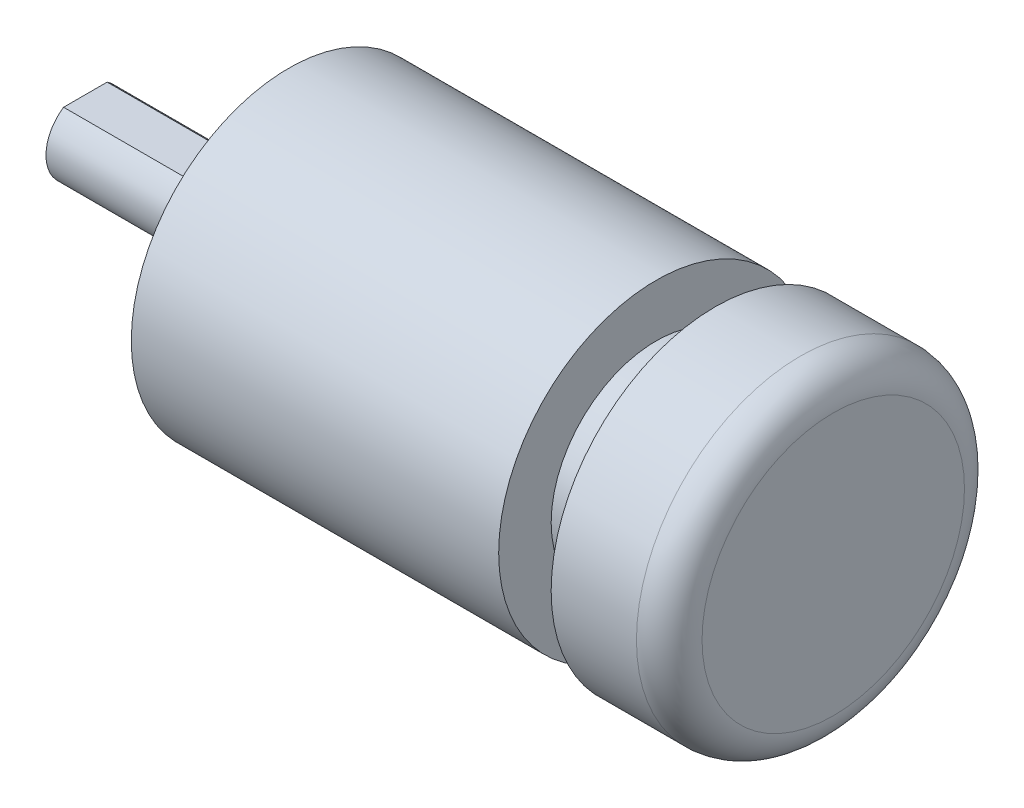
ISO-10303-21;
HEADER;
FILE_DESCRIPTION(('STEP AP214'),'2;1');
FILE_NAME('part.step','',(''),(''),'','','');
FILE_SCHEMA(('AUTOMOTIVE_DESIGN { 1 0 10303 214 1 1 1 1 }'));
ENDSEC;
DATA;
#1=APPLICATION_CONTEXT('core data for automotive mechanical design processes');
#2=APPLICATION_PROTOCOL_DEFINITION('international standard','automotive_design',2000,#1);
#3=PRODUCT_CONTEXT('',#1,'mechanical');
#4=PRODUCT('Part','Part','',(#3));
#5=PRODUCT_RELATED_PRODUCT_CATEGORY('part','',(#4));
#6=PRODUCT_DEFINITION_FORMATION('','',#4);
#7=PRODUCT_DEFINITION_CONTEXT('part definition',#1,'design');
#8=PRODUCT_DEFINITION('design','',#6,#7);
#9=PRODUCT_DEFINITION_SHAPE('','',#8);
#10=(LENGTH_UNIT() NAMED_UNIT(*) SI_UNIT(.MILLI.,.METRE.));
#11=(NAMED_UNIT(*) PLANE_ANGLE_UNIT() SI_UNIT($,.RADIAN.));
#12=(NAMED_UNIT(*) SI_UNIT($,.STERADIAN.) SOLID_ANGLE_UNIT());
#13=UNCERTAINTY_MEASURE_WITH_UNIT(LENGTH_MEASURE(1.E-05),#10,'distance_accuracy_value','');
#14=(GEOMETRIC_REPRESENTATION_CONTEXT(3) GLOBAL_UNCERTAINTY_ASSIGNED_CONTEXT((#13)) GLOBAL_UNIT_ASSIGNED_CONTEXT((#10,
#11,#12)) REPRESENTATION_CONTEXT('',''));
#15=CARTESIAN_POINT('',(0.,0.,0.));
#16=DIRECTION('',(0.,0.,1.));
#17=DIRECTION('',(1.,0.,0.));
#18=AXIS2_PLACEMENT_3D('',#15,#16,#17);
#19=CARTESIAN_POINT('',(-43.5,0.,0.));
#20=DIRECTION('',(-1.,0.,0.));
#21=DIRECTION('',(0.,0.,1.));
#22=AXIS2_PLACEMENT_3D('',#19,#20,#21);
#23=PLANE('',#22);
#24=CARTESIAN_POINT('',(-43.5,0.,0.));
#25=DIRECTION('',(-1.,0.,0.));
#26=DIRECTION('',(0.,0.,1.));
#27=AXIS2_PLACEMENT_3D('',#24,#25,#26);
#28=CIRCLE('',#27,2.99999999999999);
#29=CARTESIAN_POINT('',(-43.5,2.49999999999999,1.6583123951777));
#30=VERTEX_POINT('',#29);
#31=CARTESIAN_POINT('',(-43.5,2.49999999999999,-1.6583123951777));
#32=VERTEX_POINT('',#31);
#33=EDGE_CURVE('E78',#30,#32,#28,.F.);
#34=ORIENTED_EDGE('',*,*,#33,.F.);
#35=DIRECTION('',(0.,0.,-1.));
#36=VECTOR('',#35,1.);
#37=CARTESIAN_POINT('',(-43.5,2.49999999999999,-1.6583123951777));
#38=LINE('',#37,#36);
#39=EDGE_CURVE('E86',#30,#32,#38,.T.);
#40=ORIENTED_EDGE('',*,*,#39,.T.);
#41=EDGE_LOOP('',(#34,#40));
#42=FACE_BOUND('',#41,.T.);
#43=ADVANCED_FACE('F43',(#42),#23,.T.);
#44=CARTESIAN_POINT('',(13.5,0.,0.));
#45=DIRECTION('',(1.,0.,0.));
#46=DIRECTION('',(0.,0.,-1.));
#47=AXIS2_PLACEMENT_3D('',#44,#45,#46);
#48=PLANE('',#47);
#49=CARTESIAN_POINT('',(13.5,0.,0.));
#50=DIRECTION('',(-1.,0.,0.));
#51=DIRECTION('',(0.,0.,1.));
#52=AXIS2_PLACEMENT_3D('',#49,#50,#51);
#53=CIRCLE('',#52,10.);
#54=CARTESIAN_POINT('',(13.5,0.,10.));
#55=VERTEX_POINT('',#54);
#56=CARTESIAN_POINT('',(13.5,0.,-10.));
#57=VERTEX_POINT('',#56);
#58=EDGE_CURVE('E109',#55,#57,#53,.T.);
#59=ORIENTED_EDGE('',*,*,#58,.F.);
#60=CARTESIAN_POINT('',(13.5,0.,0.));
#61=DIRECTION('',(-1.,0.,0.));
#62=DIRECTION('',(0.,0.,-1.));
#63=AXIS2_PLACEMENT_3D('',#60,#61,#62);
#64=CIRCLE('',#63,10.);
#65=EDGE_CURVE('E71',#57,#55,#64,.T.);
#66=ORIENTED_EDGE('',*,*,#65,.F.);
#67=EDGE_LOOP('',(#59,#66));
#68=FACE_BOUND('',#67,.T.);
#69=ADVANCED_FACE('F191',(#68),#48,.T.);
#70=CARTESIAN_POINT('',(11.,0.,0.));
#71=DIRECTION('',(1.,0.,0.));
#72=DIRECTION('',(0.,0.,-1.));
#73=AXIS2_PLACEMENT_3D('',#70,#71,#72);
#74=TOROIDAL_SURFACE('',#73,10.,2.5);
#75=ORIENTED_EDGE('',*,*,#65,.T.);
#76=ORIENTED_EDGE('',*,*,#58,.T.);
#77=EDGE_LOOP('',(#75,#76));
#78=FACE_BOUND('',#77,.T.);
#79=CARTESIAN_POINT('',(11.,0.,0.));
#80=DIRECTION('',(1.,0.,0.));
#81=DIRECTION('',(0.,0.,-1.));
#82=AXIS2_PLACEMENT_3D('',#79,#80,#81);
#83=CIRCLE('',#82,12.5);
#84=CARTESIAN_POINT('',(11.,0.,-12.5));
#85=VERTEX_POINT('',#84);
#86=EDGE_CURVE('E110',#85,#85,#83,.F.);
#87=ORIENTED_EDGE('',*,*,#86,.F.);
#88=EDGE_LOOP('',(#87));
#89=FACE_BOUND('',#88,.T.);
#90=ADVANCED_FACE('F179',(#78,#89),#74,.T.);
#91=CARTESIAN_POINT('',(4.5,0.,0.));
#92=DIRECTION('',(1.,0.,0.));
#93=DIRECTION('',(0.,0.,-1.));
#94=AXIS2_PLACEMENT_3D('',#91,#92,#93);
#95=CYLINDRICAL_SURFACE('',#94,12.5);
#96=ORIENTED_EDGE('',*,*,#86,.T.);
#97=EDGE_LOOP('',(#96));
#98=FACE_BOUND('',#97,.T.);
#99=CARTESIAN_POINT('',(4.5,0.,0.));
#100=DIRECTION('',(1.,0.,0.));
#101=DIRECTION('',(0.,0.,-1.));
#102=AXIS2_PLACEMENT_3D('',#99,#100,#101);
#103=CIRCLE('',#102,12.5);
#104=CARTESIAN_POINT('',(4.5,0.,-12.5));
#105=VERTEX_POINT('',#104);
#106=EDGE_CURVE('E115',#105,#105,#103,.T.);
#107=ORIENTED_EDGE('',*,*,#106,.T.);
#108=EDGE_LOOP('',(#107));
#109=FACE_BOUND('',#108,.T.);
#110=ADVANCED_FACE('F190',(#98,#109),#95,.T.);
#111=CARTESIAN_POINT('',(4.5,0.,0.));
#112=DIRECTION('',(1.,0.,0.));
#113=DIRECTION('',(0.,0.,-1.));
#114=AXIS2_PLACEMENT_3D('',#111,#112,#113);
#115=PLANE('',#114);
#116=ORIENTED_EDGE('',*,*,#106,.F.);
#117=EDGE_LOOP('',(#116));
#118=FACE_BOUND('',#117,.T.);
#119=CARTESIAN_POINT('',(4.5,0.,0.));
#120=DIRECTION('',(-1.,0.,0.));
#121=DIRECTION('',(0.,0.,1.));
#122=AXIS2_PLACEMENT_3D('',#119,#120,#121);
#123=CIRCLE('',#122,8.);
#124=CARTESIAN_POINT('',(4.5,0.,8.));
#125=VERTEX_POINT('',#124);
#126=EDGE_CURVE('E139',#125,#125,#123,.T.);
#127=ORIENTED_EDGE('',*,*,#126,.F.);
#128=EDGE_LOOP('',(#127));
#129=FACE_BOUND('',#128,.T.);
#130=ADVANCED_FACE('F209',(#118,#129),#115,.F.);
#131=CARTESIAN_POINT('',(13.502,0.,0.));
#132=DIRECTION('',(-1.,0.,0.));
#133=DIRECTION('',(0.,0.,1.));
#134=AXIS2_PLACEMENT_3D('',#131,#132,#133);
#135=CYLINDRICAL_SURFACE('',#134,8.);
#136=CARTESIAN_POINT('',(0.,0.,0.));
#137=DIRECTION('',(-1.,0.,0.));
#138=DIRECTION('',(0.,0.,1.));
#139=AXIS2_PLACEMENT_3D('',#136,#137,#138);
#140=CIRCLE('',#139,8.);
#141=CARTESIAN_POINT('',(0.,0.,8.));
#142=VERTEX_POINT('',#141);
#143=EDGE_CURVE('E163',#142,#142,#140,.T.);
#144=ORIENTED_EDGE('',*,*,#143,.F.);
#145=EDGE_LOOP('',(#144));
#146=FACE_BOUND('',#145,.T.);
#147=ORIENTED_EDGE('',*,*,#126,.T.);
#148=EDGE_LOOP('',(#147));
#149=FACE_BOUND('',#148,.T.);
#150=ADVANCED_FACE('F214',(#146,#149),#135,.T.);
#151=CARTESIAN_POINT('',(-22.,9.,0.));
#152=DIRECTION('',(-1.,0.,0.));
#153=DIRECTION('',(0.,0.,1.));
#154=AXIS2_PLACEMENT_3D('',#151,#152,#153);
#155=PLANE('',#154);
#156=CARTESIAN_POINT('',(-22.,9.,0.));
#157=DIRECTION('',(-1.,0.,0.));
#158=DIRECTION('',(0.,0.,1.));
#159=AXIS2_PLACEMENT_3D('',#156,#157,#158);
#160=CIRCLE('',#159,1.);
#161=CARTESIAN_POINT('',(-22.,9.,1.));
#162=VERTEX_POINT('',#161);
#163=EDGE_CURVE('E119',#162,#162,#160,.T.);
#164=ORIENTED_EDGE('',*,*,#163,.T.);
#165=EDGE_LOOP('',(#164));
#166=FACE_BOUND('',#165,.T.);
#167=ADVANCED_FACE('F219',(#166),#155,.T.);
#168=CARTESIAN_POINT('',(-22.,0.,9.));
#169=DIRECTION('',(-1.,0.,0.));
#170=DIRECTION('',(0.,0.,1.));
#171=AXIS2_PLACEMENT_3D('',#168,#169,#170);
#172=PLANE('',#171);
#173=CARTESIAN_POINT('',(-22.,0.,9.));
#174=DIRECTION('',(-1.,0.,0.));
#175=DIRECTION('',(0.,0.,1.));
#176=AXIS2_PLACEMENT_3D('',#173,#174,#175);
#177=CIRCLE('',#176,1.);
#178=CARTESIAN_POINT('',(-22.,0.,10.));
#179=VERTEX_POINT('',#178);
#180=EDGE_CURVE('E123',#179,#179,#177,.T.);
#181=ORIENTED_EDGE('',*,*,#180,.T.);
#182=EDGE_LOOP('',(#181));
#183=FACE_BOUND('',#182,.T.);
#184=ADVANCED_FACE('F225',(#183),#172,.T.);
#185=CARTESIAN_POINT('',(-22.,-9.,0.));
#186=DIRECTION('',(-1.,0.,0.));
#187=DIRECTION('',(0.,0.,1.));
#188=AXIS2_PLACEMENT_3D('',#185,#186,#187);
#189=PLANE('',#188);
#190=CARTESIAN_POINT('',(-22.,-9.,0.));
#191=DIRECTION('',(-1.,0.,0.));
#192=DIRECTION('',(0.,0.,1.));
#193=AXIS2_PLACEMENT_3D('',#190,#191,#192);
#194=CIRCLE('',#193,1.);
#195=CARTESIAN_POINT('',(-22.,-9.,1.));
#196=VERTEX_POINT('',#195);
#197=EDGE_CURVE('E127',#196,#196,#194,.T.);
#198=ORIENTED_EDGE('',*,*,#197,.T.);
#199=EDGE_LOOP('',(#198));
#200=FACE_BOUND('',#199,.T.);
#201=ADVANCED_FACE('F394',(#200),#189,.T.);
#202=CARTESIAN_POINT('',(-22.,0.,-9.));
#203=DIRECTION('',(-1.,0.,0.));
#204=DIRECTION('',(0.,0.,1.));
#205=AXIS2_PLACEMENT_3D('',#202,#203,#204);
#206=PLANE('',#205);
#207=CARTESIAN_POINT('',(-22.,0.,-9.));
#208=DIRECTION('',(-1.,0.,0.));
#209=DIRECTION('',(0.,0.,1.));
#210=AXIS2_PLACEMENT_3D('',#207,#208,#209);
#211=CIRCLE('',#210,1.);
#212=CARTESIAN_POINT('',(-22.,0.,-8.));
#213=VERTEX_POINT('',#212);
#214=EDGE_CURVE('E131',#213,#213,#211,.T.);
#215=ORIENTED_EDGE('',*,*,#214,.T.);
#216=EDGE_LOOP('',(#215));
#217=FACE_BOUND('',#216,.T.);
#218=ADVANCED_FACE('F384',(#217),#206,.T.);
#219=CARTESIAN_POINT('',(0.,0.,0.));
#220=DIRECTION('',(1.,0.,0.));
#221=DIRECTION('',(0.,0.,-1.));
#222=AXIS2_PLACEMENT_3D('',#219,#220,#221);
#223=PLANE('',#222);
#224=CARTESIAN_POINT('',(0.,0.,0.));
#225=DIRECTION('',(1.,0.,0.));
#226=DIRECTION('',(0.,0.,-1.));
#227=AXIS2_PLACEMENT_3D('',#224,#225,#226);
#228=CIRCLE('',#227,12.);
#229=CARTESIAN_POINT('',(0.,0.,-12.));
#230=VERTEX_POINT('',#229);
#231=EDGE_CURVE('E85',#230,#230,#228,.F.);
#232=ORIENTED_EDGE('',*,*,#231,.F.);
#233=EDGE_LOOP('',(#232));
#234=FACE_BOUND('',#233,.T.);
#235=ORIENTED_EDGE('',*,*,#143,.T.);
#236=EDGE_LOOP('',(#235));
#237=FACE_BOUND('',#236,.T.);
#238=ADVANCED_FACE('F374',(#234,#237),#223,.T.);
#239=CARTESIAN_POINT('',(-22.,9.,0.));
#240=DIRECTION('',(-1.,0.,0.));
#241=DIRECTION('',(0.,0.,1.));
#242=AXIS2_PLACEMENT_3D('',#239,#240,#241);
#243=CYLINDRICAL_SURFACE('',#242,1.);
#244=CARTESIAN_POINT('',(-28.,9.,0.));
#245=DIRECTION('',(-1.,0.,0.));
#246=DIRECTION('',(0.,0.,1.));
#247=AXIS2_PLACEMENT_3D('',#244,#245,#246);
#248=CIRCLE('',#247,1.);
#249=CARTESIAN_POINT('',(-28.,9.,1.));
#250=VERTEX_POINT('',#249);
#251=EDGE_CURVE('E143',#250,#250,#248,.F.);
#252=ORIENTED_EDGE('',*,*,#251,.F.);
#253=EDGE_LOOP('',(#252));
#254=FACE_BOUND('',#253,.T.);
#255=ORIENTED_EDGE('',*,*,#163,.F.);
#256=EDGE_LOOP('',(#255));
#257=FACE_BOUND('',#256,.T.);
#258=ADVANCED_FACE('F364',(#254,#257),#243,.F.);
#259=CARTESIAN_POINT('',(-22.,0.,9.));
#260=DIRECTION('',(-1.,0.,0.));
#261=DIRECTION('',(0.,0.,1.));
#262=AXIS2_PLACEMENT_3D('',#259,#260,#261);
#263=CYLINDRICAL_SURFACE('',#262,1.);
#264=CARTESIAN_POINT('',(-28.,0.,9.));
#265=DIRECTION('',(-1.,0.,0.));
#266=DIRECTION('',(0.,0.,1.));
#267=AXIS2_PLACEMENT_3D('',#264,#265,#266);
#268=CIRCLE('',#267,1.);
#269=CARTESIAN_POINT('',(-28.,0.,10.));
#270=VERTEX_POINT('',#269);
#271=EDGE_CURVE('E147',#270,#270,#268,.F.);
#272=ORIENTED_EDGE('',*,*,#271,.F.);
#273=EDGE_LOOP('',(#272));
#274=FACE_BOUND('',#273,.T.);
#275=ORIENTED_EDGE('',*,*,#180,.F.);
#276=EDGE_LOOP('',(#275));
#277=FACE_BOUND('',#276,.T.);
#278=ADVANCED_FACE('F354',(#274,#277),#263,.F.);
#279=CARTESIAN_POINT('',(-22.,-9.,0.));
#280=DIRECTION('',(-1.,0.,0.));
#281=DIRECTION('',(0.,0.,1.));
#282=AXIS2_PLACEMENT_3D('',#279,#280,#281);
#283=CYLINDRICAL_SURFACE('',#282,1.);
#284=CARTESIAN_POINT('',(-28.,-9.,0.));
#285=DIRECTION('',(-1.,0.,0.));
#286=DIRECTION('',(0.,0.,1.));
#287=AXIS2_PLACEMENT_3D('',#284,#285,#286);
#288=CIRCLE('',#287,1.);
#289=CARTESIAN_POINT('',(-28.,-9.,1.));
#290=VERTEX_POINT('',#289);
#291=EDGE_CURVE('E151',#290,#290,#288,.F.);
#292=ORIENTED_EDGE('',*,*,#291,.F.);
#293=EDGE_LOOP('',(#292));
#294=FACE_BOUND('',#293,.T.);
#295=ORIENTED_EDGE('',*,*,#197,.F.);
#296=EDGE_LOOP('',(#295));
#297=FACE_BOUND('',#296,.T.);
#298=ADVANCED_FACE('F344',(#294,#297),#283,.F.);
#299=CARTESIAN_POINT('',(-22.,0.,-9.));
#300=DIRECTION('',(-1.,0.,0.));
#301=DIRECTION('',(0.,0.,1.));
#302=AXIS2_PLACEMENT_3D('',#299,#300,#301);
#303=CYLINDRICAL_SURFACE('',#302,1.);
#304=CARTESIAN_POINT('',(-28.,0.,-9.));
#305=DIRECTION('',(-1.,0.,0.));
#306=DIRECTION('',(0.,0.,1.));
#307=AXIS2_PLACEMENT_3D('',#304,#305,#306);
#308=CIRCLE('',#307,1.);
#309=CARTESIAN_POINT('',(-28.,0.,-8.));
#310=VERTEX_POINT('',#309);
#311=EDGE_CURVE('E155',#310,#310,#308,.F.);
#312=ORIENTED_EDGE('',*,*,#311,.F.);
#313=EDGE_LOOP('',(#312));
#314=FACE_BOUND('',#313,.T.);
#315=ORIENTED_EDGE('',*,*,#214,.F.);
#316=EDGE_LOOP('',(#315));
#317=FACE_BOUND('',#316,.T.);
#318=ADVANCED_FACE('F332',(#314,#317),#303,.F.);
#319=CARTESIAN_POINT('',(0.,0.,0.));
#320=DIRECTION('',(1.,0.,0.));
#321=DIRECTION('',(0.,0.,-1.));
#322=AXIS2_PLACEMENT_3D('',#319,#320,#321);
#323=CYLINDRICAL_SURFACE('',#322,12.);
#324=ORIENTED_EDGE('',*,*,#231,.T.);
#325=EDGE_LOOP('',(#324));
#326=FACE_BOUND('',#325,.T.);
#327=CARTESIAN_POINT('',(-28.,0.,0.));
#328=DIRECTION('',(1.,0.,0.));
#329=DIRECTION('',(0.,0.,-1.));
#330=AXIS2_PLACEMENT_3D('',#327,#328,#329);
#331=CIRCLE('',#330,12.);
#332=CARTESIAN_POINT('',(-28.,0.,-12.));
#333=VERTEX_POINT('',#332);
#334=EDGE_CURVE('E167',#333,#333,#331,.T.);
#335=ORIENTED_EDGE('',*,*,#334,.T.);
#336=EDGE_LOOP('',(#335));
#337=FACE_BOUND('',#336,.T.);
#338=ADVANCED_FACE('F322',(#326,#337),#323,.T.);
#339=CARTESIAN_POINT('',(-28.,12.,0.));
#340=DIRECTION('',(-1.,0.,0.));
#341=DIRECTION('',(0.,0.,1.));
#342=AXIS2_PLACEMENT_3D('',#339,#340,#341);
#343=PLANE('',#342);
#344=ORIENTED_EDGE('',*,*,#334,.F.);
#345=EDGE_LOOP('',(#344));
#346=FACE_BOUND('',#345,.T.);
#347=CARTESIAN_POINT('',(-28.,0.,0.));
#348=DIRECTION('',(1.,0.,0.));
#349=DIRECTION('',(0.,0.,-1.));
#350=AXIS2_PLACEMENT_3D('',#347,#348,#349);
#351=CIRCLE('',#350,7.);
#352=CARTESIAN_POINT('',(-28.,0.,-7.));
#353=VERTEX_POINT('',#352);
#354=EDGE_CURVE('E159',#353,#353,#351,.T.);
#355=ORIENTED_EDGE('',*,*,#354,.T.);
#356=EDGE_LOOP('',(#355));
#357=FACE_BOUND('',#356,.T.);
#358=ORIENTED_EDGE('',*,*,#311,.T.);
#359=EDGE_LOOP('',(#358));
#360=FACE_BOUND('',#359,.T.);
#361=ORIENTED_EDGE('',*,*,#291,.T.);
#362=EDGE_LOOP('',(#361));
#363=FACE_BOUND('',#362,.T.);
#364=ORIENTED_EDGE('',*,*,#271,.T.);
#365=EDGE_LOOP('',(#364));
#366=FACE_BOUND('',#365,.T.);
#367=ORIENTED_EDGE('',*,*,#251,.T.);
#368=EDGE_LOOP('',(#367));
#369=FACE_BOUND('',#368,.T.);
#370=ADVANCED_FACE('F313',(#346,#357,#360,#363,#366,#369),#343,.T.);
#371=CARTESIAN_POINT('',(0.,0.,0.));
#372=DIRECTION('',(1.,0.,0.));
#373=DIRECTION('',(0.,0.,-1.));
#374=AXIS2_PLACEMENT_3D('',#371,#372,#373);
#375=CYLINDRICAL_SURFACE('',#374,7.);
#376=CARTESIAN_POINT('',(-29.5,0.,0.));
#377=DIRECTION('',(1.,0.,0.));
#378=DIRECTION('',(0.,0.,-1.));
#379=AXIS2_PLACEMENT_3D('',#376,#377,#378);
#380=CIRCLE('',#379,7.);
#381=CARTESIAN_POINT('',(-29.5,0.,-7.));
#382=VERTEX_POINT('',#381);
#383=EDGE_CURVE('E135',#382,#382,#380,.T.);
#384=ORIENTED_EDGE('',*,*,#383,.T.);
#385=EDGE_LOOP('',(#384));
#386=FACE_BOUND('',#385,.T.);
#387=ORIENTED_EDGE('',*,*,#354,.F.);
#388=EDGE_LOOP('',(#387));
#389=FACE_BOUND('',#388,.T.);
#390=ADVANCED_FACE('F265',(#386,#389),#375,.T.);
#391=CARTESIAN_POINT('',(-29.5,7.,0.));
#392=DIRECTION('',(-1.,0.,0.));
#393=DIRECTION('',(0.,0.,1.));
#394=AXIS2_PLACEMENT_3D('',#391,#392,#393);
#395=PLANE('',#394);
#396=ORIENTED_EDGE('',*,*,#383,.F.);
#397=EDGE_LOOP('',(#396));
#398=FACE_BOUND('',#397,.T.);
#399=CARTESIAN_POINT('',(-29.5,0.,0.));
#400=DIRECTION('',(1.,0.,0.));
#401=DIRECTION('',(0.,0.,-1.));
#402=AXIS2_PLACEMENT_3D('',#399,#400,#401);
#403=CIRCLE('',#402,5.);
#404=CARTESIAN_POINT('',(-29.5,0.,-5.));
#405=VERTEX_POINT('',#404);
#406=EDGE_CURVE('E111',#405,#405,#403,.T.);
#407=ORIENTED_EDGE('',*,*,#406,.T.);
#408=EDGE_LOOP('',(#407));
#409=FACE_BOUND('',#408,.T.);
#410=ADVANCED_FACE('F260',(#398,#409),#395,.T.);
#411=CARTESIAN_POINT('',(0.,0.,0.));
#412=DIRECTION('',(1.,0.,0.));
#413=DIRECTION('',(0.,0.,-1.));
#414=AXIS2_PLACEMENT_3D('',#411,#412,#413);
#415=CYLINDRICAL_SURFACE('',#414,5.);
#416=CARTESIAN_POINT('',(-30.,0.,0.));
#417=DIRECTION('',(1.,0.,0.));
#418=DIRECTION('',(0.,0.,-1.));
#419=AXIS2_PLACEMENT_3D('',#416,#417,#418);
#420=CIRCLE('',#419,5.);
#421=CARTESIAN_POINT('',(-30.,0.,-5.));
#422=VERTEX_POINT('',#421);
#423=EDGE_CURVE('E105',#422,#422,#420,.T.);
#424=ORIENTED_EDGE('',*,*,#423,.T.);
#425=EDGE_LOOP('',(#424));
#426=FACE_BOUND('',#425,.T.);
#427=ORIENTED_EDGE('',*,*,#406,.F.);
#428=EDGE_LOOP('',(#427));
#429=FACE_BOUND('',#428,.T.);
#430=ADVANCED_FACE('F195',(#426,#429),#415,.T.);
#431=CARTESIAN_POINT('',(-33.5,0.,0.));
#432=DIRECTION('',(-1.,0.,0.));
#433=DIRECTION('',(0.,0.,1.));
#434=AXIS2_PLACEMENT_3D('',#431,#432,#433);
#435=PLANE('',#434);
#436=CARTESIAN_POINT('',(-33.5,0.,0.));
#437=DIRECTION('',(1.,0.,0.));
#438=DIRECTION('',(0.,0.,-1.));
#439=AXIS2_PLACEMENT_3D('',#436,#437,#438);
#440=CIRCLE('',#439,2.99999999999999);
#441=CARTESIAN_POINT('',(-33.5,2.49999999999999,-1.6583123951777));
#442=VERTEX_POINT('',#441);
#443=CARTESIAN_POINT('',(-33.5,2.49999999999999,1.6583123951777));
#444=VERTEX_POINT('',#443);
#445=EDGE_CURVE('E94',#442,#444,#440,.T.);
#446=ORIENTED_EDGE('',*,*,#445,.F.);
#447=DIRECTION('',(0.,0.,-1.));
#448=VECTOR('',#447,1.);
#449=CARTESIAN_POINT('',(-33.5,2.49999999999999,-1.6583123951777));
#450=LINE('',#449,#448);
#451=EDGE_CURVE('E11',#442,#444,#450,.F.);
#452=ORIENTED_EDGE('',*,*,#451,.T.);
#453=EDGE_LOOP('',(#446,#452));
#454=FACE_BOUND('',#453,.T.);
#455=ADVANCED_FACE('F238',(#454),#435,.T.);
#456=CARTESIAN_POINT('',(-33.5,2.49999999999999,-1.6583123951777));
#457=DIRECTION('',(0.,-1.,0.));
#458=DIRECTION('',(0.,0.,-1.));
#459=AXIS2_PLACEMENT_3D('',#456,#457,#458);
#460=PLANE('',#459);
#461=ORIENTED_EDGE('',*,*,#39,.F.);
#462=DIRECTION('',(1.,0.,0.));
#463=VECTOR('',#462,1.);
#464=CARTESIAN_POINT('',(0.,2.49999999999999,1.6583123951777));
#465=LINE('',#464,#463);
#466=EDGE_CURVE('E83',#444,#30,#465,.F.);
#467=ORIENTED_EDGE('',*,*,#466,.F.);
#468=ORIENTED_EDGE('',*,*,#451,.F.);
#469=DIRECTION('',(1.,0.,0.));
#470=VECTOR('',#469,1.);
#471=CARTESIAN_POINT('',(0.,2.49999999999999,-1.6583123951777));
#472=LINE('',#471,#470);
#473=EDGE_CURVE('E47',#32,#442,#472,.T.);
#474=ORIENTED_EDGE('',*,*,#473,.F.);
#475=EDGE_LOOP('',(#461,#467,#468,#474));
#476=FACE_BOUND('',#475,.T.);
#477=ADVANCED_FACE('F91',(#476),#460,.F.);
#478=CARTESIAN_POINT('',(-30.,5.,0.));
#479=DIRECTION('',(-1.,0.,0.));
#480=DIRECTION('',(0.,0.,1.));
#481=AXIS2_PLACEMENT_3D('',#478,#479,#480);
#482=PLANE('',#481);
#483=ORIENTED_EDGE('',*,*,#423,.F.);
#484=EDGE_LOOP('',(#483));
#485=FACE_BOUND('',#484,.T.);
#486=CARTESIAN_POINT('',(-30.,0.,0.));
#487=DIRECTION('',(1.,0.,0.));
#488=DIRECTION('',(0.,0.,-1.));
#489=AXIS2_PLACEMENT_3D('',#486,#487,#488);
#490=CIRCLE('',#489,2.99999999999999);
#491=CARTESIAN_POINT('',(-30.,0.,-2.99999999999999));
#492=VERTEX_POINT('',#491);
#493=EDGE_CURVE('E98',#492,#492,#490,.T.);
#494=ORIENTED_EDGE('',*,*,#493,.T.);
#495=EDGE_LOOP('',(#494));
#496=FACE_BOUND('',#495,.T.);
#497=ADVANCED_FACE('F193',(#485,#496),#482,.T.);
#498=CARTESIAN_POINT('',(0.,0.,0.));
#499=DIRECTION('',(1.,0.,0.));
#500=DIRECTION('',(0.,0.,-1.));
#501=AXIS2_PLACEMENT_3D('',#498,#499,#500);
#502=CYLINDRICAL_SURFACE('',#501,2.99999999999999);
#503=ORIENTED_EDGE('',*,*,#493,.F.);
#504=EDGE_LOOP('',(#503));
#505=FACE_BOUND('',#504,.T.);
#506=ORIENTED_EDGE('',*,*,#466,.T.);
#507=ORIENTED_EDGE('',*,*,#33,.T.);
#508=ORIENTED_EDGE('',*,*,#473,.T.);
#509=ORIENTED_EDGE('',*,*,#445,.T.);
#510=EDGE_LOOP('',(#506,#507,#508,#509));
#511=FACE_BOUND('',#510,.T.);
#512=ADVANCED_FACE('F45',(#505,#511),#502,.T.);
#513=CLOSED_SHELL('',(#43,#69,#90,#110,#130,#150,#167,#184,#201,#218,#238,#258,#278,#298,#318,
#338,#370,#390,#410,#430,#455,#477,#497,#512));
#514=MANIFOLD_SOLID_BREP('B2',#513);
#515=ADVANCED_BREP_SHAPE_REPRESENTATION('',(#18,#514),#14);
#516=SHAPE_DEFINITION_REPRESENTATION(#9,#515);
ENDSEC;
END-ISO-10303-21;
